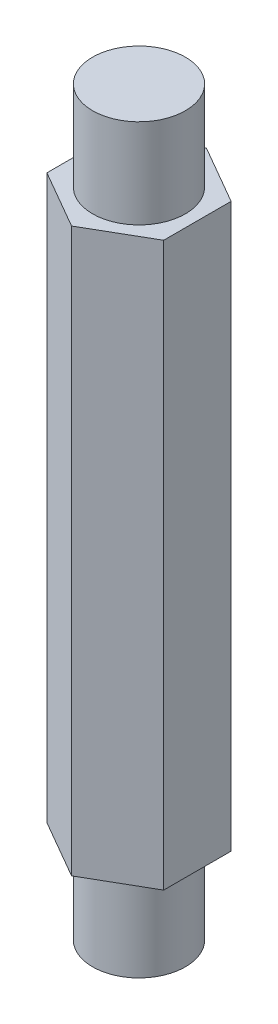
ISO-10303-21;
HEADER;
FILE_DESCRIPTION(('STEP AP214'),'2;1');
FILE_NAME('part.step','',(''),(''),'','','');
FILE_SCHEMA(('AUTOMOTIVE_DESIGN { 1 0 10303 214 1 1 1 1 }'));
ENDSEC;
DATA;
#1=APPLICATION_CONTEXT('core data for automotive mechanical design processes');
#2=APPLICATION_PROTOCOL_DEFINITION('international standard','automotive_design',2000,#1);
#3=PRODUCT_CONTEXT('',#1,'mechanical');
#4=PRODUCT('Part','Part','',(#3));
#5=PRODUCT_RELATED_PRODUCT_CATEGORY('part','',(#4));
#6=PRODUCT_DEFINITION_FORMATION('','',#4);
#7=PRODUCT_DEFINITION_CONTEXT('part definition',#1,'design');
#8=PRODUCT_DEFINITION('design','',#6,#7);
#9=PRODUCT_DEFINITION_SHAPE('','',#8);
#10=(LENGTH_UNIT() NAMED_UNIT(*) SI_UNIT(.MILLI.,.METRE.));
#11=(NAMED_UNIT(*) PLANE_ANGLE_UNIT() SI_UNIT($,.RADIAN.));
#12=(NAMED_UNIT(*) SI_UNIT($,.STERADIAN.) SOLID_ANGLE_UNIT());
#13=UNCERTAINTY_MEASURE_WITH_UNIT(LENGTH_MEASURE(1.E-05),#10,'distance_accuracy_value','');
#14=(GEOMETRIC_REPRESENTATION_CONTEXT(3) GLOBAL_UNCERTAINTY_ASSIGNED_CONTEXT((#13)) GLOBAL_UNIT_ASSIGNED_CONTEXT((#10,
#11,#12)) REPRESENTATION_CONTEXT('',''));
#15=CARTESIAN_POINT('',(0.,0.,0.));
#16=DIRECTION('',(0.,0.,1.));
#17=DIRECTION('',(1.,0.,0.));
#18=AXIS2_PLACEMENT_3D('',#15,#16,#17);
#19=CARTESIAN_POINT('',(0.,23.175,0.));
#20=DIRECTION('',(0.,-1.,0.));
#21=DIRECTION('',(0.,0.,-1.));
#22=AXIS2_PLACEMENT_3D('',#19,#20,#21);
#23=CYLINDRICAL_SURFACE('',#22,1.65);
#24=CARTESIAN_POINT('',(0.,23.175,0.));
#25=DIRECTION('',(0.,1.,0.));
#26=DIRECTION('',(0.,0.,1.));
#27=AXIS2_PLACEMENT_3D('',#24,#25,#26);
#28=CIRCLE('',#27,1.65);
#29=CARTESIAN_POINT('',(0.,23.175,1.65));
#30=VERTEX_POINT('',#29);
#31=EDGE_CURVE('E11',#30,#30,#28,.T.);
#32=ORIENTED_EDGE('',*,*,#31,.F.);
#33=EDGE_LOOP('',(#32));
#34=FACE_BOUND('',#33,.T.);
#35=CARTESIAN_POINT('',(0.,20.,0.));
#36=DIRECTION('',(0.,1.,0.));
#37=DIRECTION('',(0.,0.,1.));
#38=AXIS2_PLACEMENT_3D('',#35,#36,#37);
#39=CIRCLE('',#38,1.65);
#40=CARTESIAN_POINT('',(0.,20.,1.65));
#41=VERTEX_POINT('',#40);
#42=EDGE_CURVE('E45',#41,#41,#39,.T.);
#43=ORIENTED_EDGE('',*,*,#42,.T.);
#44=EDGE_LOOP('',(#43));
#45=FACE_BOUND('',#44,.T.);
#46=ADVANCED_FACE('F42',(#34,#45),#23,.T.);
#47=CARTESIAN_POINT('',(0.,23.175,0.));
#48=DIRECTION('',(0.,1.,0.));
#49=DIRECTION('',(0.,0.,1.));
#50=AXIS2_PLACEMENT_3D('',#47,#48,#49);
#51=PLANE('',#50);
#52=ORIENTED_EDGE('',*,*,#31,.T.);
#53=EDGE_LOOP('',(#52));
#54=FACE_BOUND('',#53,.T.);
#55=ADVANCED_FACE('F57',(#54),#51,.T.);
#56=CARTESIAN_POINT('',(0.,20.,0.));
#57=DIRECTION('',(0.,1.,0.));
#58=DIRECTION('',(0.,0.,1.));
#59=AXIS2_PLACEMENT_3D('',#56,#57,#58);
#60=PLANE('',#59);
#61=ORIENTED_EDGE('',*,*,#42,.F.);
#62=EDGE_LOOP('',(#61));
#63=FACE_BOUND('',#62,.T.);
#64=ADVANCED_FACE('F55',(#63),#60,.F.);
#65=CLOSED_SHELL('',(#46,#55,#64));
#66=MANIFOLD_SOLID_BREP('B2',#65);
#67=CARTESIAN_POINT('',(0.,-3.175,0.));
#68=DIRECTION('',(0.,1.,0.));
#69=DIRECTION('',(0.,0.,1.));
#70=AXIS2_PLACEMENT_3D('',#67,#68,#69);
#71=CYLINDRICAL_SURFACE('',#70,1.65);
#72=CARTESIAN_POINT('',(0.,-3.175,0.));
#73=DIRECTION('',(0.,-1.,0.));
#74=DIRECTION('',(0.,0.,-1.));
#75=AXIS2_PLACEMENT_3D('',#72,#73,#74);
#76=CIRCLE('',#75,1.65);
#77=CARTESIAN_POINT('',(0.,-3.175,-1.65));
#78=VERTEX_POINT('',#77);
#79=EDGE_CURVE('E41',#78,#78,#76,.T.);
#80=ORIENTED_EDGE('',*,*,#79,.F.);
#81=EDGE_LOOP('',(#80));
#82=FACE_BOUND('',#81,.T.);
#83=CARTESIAN_POINT('',(0.,0.,0.));
#84=DIRECTION('',(0.,-1.,0.));
#85=DIRECTION('',(0.,0.,-1.));
#86=AXIS2_PLACEMENT_3D('',#83,#84,#85);
#87=CIRCLE('',#86,1.65);
#88=CARTESIAN_POINT('',(0.,0.,-1.65));
#89=VERTEX_POINT('',#88);
#90=EDGE_CURVE('E94',#89,#89,#87,.T.);
#91=ORIENTED_EDGE('',*,*,#90,.T.);
#92=EDGE_LOOP('',(#91));
#93=FACE_BOUND('',#92,.T.);
#94=ADVANCED_FACE('F91',(#82,#93),#71,.T.);
#95=CARTESIAN_POINT('',(0.,-3.175,0.));
#96=DIRECTION('',(0.,-1.,0.));
#97=DIRECTION('',(0.,0.,-1.));
#98=AXIS2_PLACEMENT_3D('',#95,#96,#97);
#99=PLANE('',#98);
#100=ORIENTED_EDGE('',*,*,#79,.T.);
#101=EDGE_LOOP('',(#100));
#102=FACE_BOUND('',#101,.T.);
#103=ADVANCED_FACE('F106',(#102),#99,.T.);
#104=CARTESIAN_POINT('',(0.,0.,0.));
#105=DIRECTION('',(0.,-1.,0.));
#106=DIRECTION('',(0.,0.,-1.));
#107=AXIS2_PLACEMENT_3D('',#104,#105,#106);
#108=PLANE('',#107);
#109=ORIENTED_EDGE('',*,*,#90,.F.);
#110=EDGE_LOOP('',(#109));
#111=FACE_BOUND('',#110,.T.);
#112=ADVANCED_FACE('F104',(#111),#108,.F.);
#113=CLOSED_SHELL('',(#94,#103,#112));
#114=MANIFOLD_SOLID_BREP('B6',#113);
#115=CARTESIAN_POINT('',(0.,20.,0.));
#116=DIRECTION('',(0.,1.,0.));
#117=DIRECTION('',(0.,0.,1.));
#118=AXIS2_PLACEMENT_3D('',#115,#116,#117);
#119=PLANE('',#118);
#120=DIRECTION('',(0.866025403784439,0.,0.5));
#121=VECTOR('',#120,1.);
#122=CARTESIAN_POINT('',(-2.075,20.,1.19800180856847));
#123=LINE('',#122,#121);
#124=CARTESIAN_POINT('',(-2.075,20.,1.19800180856847));
#125=VERTEX_POINT('',#124);
#126=CARTESIAN_POINT('',(0.,20.,2.39600361713695));
#127=VERTEX_POINT('',#126);
#128=EDGE_CURVE('E228',#125,#127,#123,.T.);
#129=ORIENTED_EDGE('',*,*,#128,.T.);
#130=DIRECTION('',(0.866025403784438,0.,-0.5));
#131=VECTOR('',#130,1.);
#132=CARTESIAN_POINT('',(0.,20.,2.39600361713695));
#133=LINE('',#132,#131);
#134=CARTESIAN_POINT('',(2.075,20.,1.19800180856847));
#135=VERTEX_POINT('',#134);
#136=EDGE_CURVE('E186',#127,#135,#133,.T.);
#137=ORIENTED_EDGE('',*,*,#136,.T.);
#138=DIRECTION('',(0.,0.,-1.));
#139=VECTOR('',#138,1.);
#140=CARTESIAN_POINT('',(2.075,20.,1.19800180856847));
#141=LINE('',#140,#139);
#142=CARTESIAN_POINT('',(2.075,20.,-1.19800180856847));
#143=VERTEX_POINT('',#142);
#144=EDGE_CURVE('E199',#135,#143,#141,.T.);
#145=ORIENTED_EDGE('',*,*,#144,.T.);
#146=DIRECTION('',(-0.866025403784439,0.,-0.5));
#147=VECTOR('',#146,1.);
#148=CARTESIAN_POINT('',(2.075,20.,-1.19800180856847));
#149=LINE('',#148,#147);
#150=CARTESIAN_POINT('',(0.,20.,-2.39600361713695));
#151=VERTEX_POINT('',#150);
#152=EDGE_CURVE('E193',#143,#151,#149,.T.);
#153=ORIENTED_EDGE('',*,*,#152,.T.);
#154=DIRECTION('',(-0.866025403784439,0.,0.5));
#155=VECTOR('',#154,1.);
#156=CARTESIAN_POINT('',(0.,20.,-2.39600361713695));
#157=LINE('',#156,#155);
#158=CARTESIAN_POINT('',(-2.075,20.,-1.19800180856847));
#159=VERTEX_POINT('',#158);
#160=EDGE_CURVE('E197',#151,#159,#157,.T.);
#161=ORIENTED_EDGE('',*,*,#160,.T.);
#162=DIRECTION('',(0.,0.,1.));
#163=VECTOR('',#162,1.);
#164=CARTESIAN_POINT('',(-2.075,20.,-1.19800180856847));
#165=LINE('',#164,#163);
#166=EDGE_CURVE('E149',#159,#125,#165,.T.);
#167=ORIENTED_EDGE('',*,*,#166,.T.);
#168=EDGE_LOOP('',(#129,#137,#145,#153,#161,#167));
#169=FACE_BOUND('',#168,.T.);
#170=CARTESIAN_POINT('',(0.,20.,0.));
#171=DIRECTION('',(0.,1.,0.));
#172=DIRECTION('',(0.,0.,1.));
#173=AXIS2_PLACEMENT_3D('',#170,#171,#172);
#174=CIRCLE('',#173,1.65);
#175=CARTESIAN_POINT('',(0.,20.,1.65));
#176=VERTEX_POINT('',#175);
#177=EDGE_CURVE('E221',#176,#176,#174,.T.);
#178=ORIENTED_EDGE('',*,*,#177,.F.);
#179=EDGE_LOOP('',(#178));
#180=FACE_BOUND('',#179,.T.);
#181=ADVANCED_FACE('F132',(#169,#180),#119,.T.);
#182=CARTESIAN_POINT('',(0.,0.,0.));
#183=DIRECTION('',(0.,1.,0.));
#184=DIRECTION('',(0.,0.,1.));
#185=AXIS2_PLACEMENT_3D('',#182,#183,#184);
#186=PLANE('',#185);
#187=DIRECTION('',(0.866025403784439,0.,0.5));
#188=VECTOR('',#187,1.);
#189=CARTESIAN_POINT('',(-2.075,0.,1.19800180856847));
#190=LINE('',#189,#188);
#191=CARTESIAN_POINT('',(-2.075,0.,1.19800180856847));
#192=VERTEX_POINT('',#191);
#193=CARTESIAN_POINT('',(0.,0.,2.39600361713695));
#194=VERTEX_POINT('',#193);
#195=EDGE_CURVE('E217',#192,#194,#190,.T.);
#196=ORIENTED_EDGE('',*,*,#195,.F.);
#197=DIRECTION('',(0.,0.,1.));
#198=VECTOR('',#197,1.);
#199=CARTESIAN_POINT('',(-2.075,0.,-1.19800180856847));
#200=LINE('',#199,#198);
#201=CARTESIAN_POINT('',(-2.075,0.,-1.19800180856847));
#202=VERTEX_POINT('',#201);
#203=EDGE_CURVE('E178',#202,#192,#200,.T.);
#204=ORIENTED_EDGE('',*,*,#203,.F.);
#205=DIRECTION('',(-0.866025403784439,0.,0.5));
#206=VECTOR('',#205,1.);
#207=CARTESIAN_POINT('',(0.,0.,-2.39600361713695));
#208=LINE('',#207,#206);
#209=CARTESIAN_POINT('',(0.,0.,-2.39600361713695));
#210=VERTEX_POINT('',#209);
#211=EDGE_CURVE('E172',#210,#202,#208,.T.);
#212=ORIENTED_EDGE('',*,*,#211,.F.);
#213=DIRECTION('',(-0.866025403784439,0.,-0.5));
#214=VECTOR('',#213,1.);
#215=CARTESIAN_POINT('',(2.075,0.,-1.19800180856847));
#216=LINE('',#215,#214);
#217=CARTESIAN_POINT('',(2.075,0.,-1.19800180856847));
#218=VERTEX_POINT('',#217);
#219=EDGE_CURVE('E207',#218,#210,#216,.T.);
#220=ORIENTED_EDGE('',*,*,#219,.F.);
#221=DIRECTION('',(0.,0.,-1.));
#222=VECTOR('',#221,1.);
#223=CARTESIAN_POINT('',(2.075,0.,1.19800180856847));
#224=LINE('',#223,#222);
#225=CARTESIAN_POINT('',(2.075,0.,1.19800180856847));
#226=VERTEX_POINT('',#225);
#227=EDGE_CURVE('E223',#226,#218,#224,.T.);
#228=ORIENTED_EDGE('',*,*,#227,.F.);
#229=DIRECTION('',(0.866025403784438,0.,-0.5));
#230=VECTOR('',#229,1.);
#231=CARTESIAN_POINT('',(0.,0.,2.39600361713695));
#232=LINE('',#231,#230);
#233=EDGE_CURVE('E220',#194,#226,#232,.T.);
#234=ORIENTED_EDGE('',*,*,#233,.F.);
#235=EDGE_LOOP('',(#196,#204,#212,#220,#228,#234));
#236=FACE_BOUND('',#235,.T.);
#237=CARTESIAN_POINT('',(0.,0.,0.));
#238=DIRECTION('',(0.,1.,0.));
#239=DIRECTION('',(0.,0.,1.));
#240=AXIS2_PLACEMENT_3D('',#237,#238,#239);
#241=CIRCLE('',#240,1.65);
#242=CARTESIAN_POINT('',(0.,0.,1.65));
#243=VERTEX_POINT('',#242);
#244=EDGE_CURVE('E321',#243,#243,#241,.T.);
#245=ORIENTED_EDGE('',*,*,#244,.T.);
#246=EDGE_LOOP('',(#245));
#247=FACE_BOUND('',#246,.T.);
#248=ADVANCED_FACE('F237',(#236,#247),#186,.F.);
#249=CARTESIAN_POINT('',(-2.075,20.,1.19800180856847));
#250=DIRECTION('',(0.5,0.,-0.866025403784439));
#251=DIRECTION('',(-0.866025403784439,0.,-0.5));
#252=AXIS2_PLACEMENT_3D('',#249,#250,#251);
#253=PLANE('',#252);
#254=ORIENTED_EDGE('',*,*,#195,.T.);
#255=DIRECTION('',(0.,-1.,0.));
#256=VECTOR('',#255,1.);
#257=CARTESIAN_POINT('',(0.,20.,2.39600361713695));
#258=LINE('',#257,#256);
#259=EDGE_CURVE('E89',#127,#194,#258,.T.);
#260=ORIENTED_EDGE('',*,*,#259,.F.);
#261=ORIENTED_EDGE('',*,*,#128,.F.);
#262=DIRECTION('',(0.,-1.,0.));
#263=VECTOR('',#262,1.);
#264=CARTESIAN_POINT('',(-2.075,20.,1.19800180856847));
#265=LINE('',#264,#263);
#266=EDGE_CURVE('E213',#125,#192,#265,.T.);
#267=ORIENTED_EDGE('',*,*,#266,.T.);
#268=EDGE_LOOP('',(#254,#260,#261,#267));
#269=FACE_BOUND('',#268,.T.);
#270=ADVANCED_FACE('F134',(#269),#253,.F.);
#271=CARTESIAN_POINT('',(0.,20.,2.39600361713695));
#272=DIRECTION('',(-0.5,0.,-0.866025403784439));
#273=DIRECTION('',(-0.866025403784439,0.,0.5));
#274=AXIS2_PLACEMENT_3D('',#271,#272,#273);
#275=PLANE('',#274);
#276=ORIENTED_EDGE('',*,*,#233,.T.);
#277=DIRECTION('',(0.,-1.,0.));
#278=VECTOR('',#277,1.);
#279=CARTESIAN_POINT('',(2.075,20.,1.19800180856847));
#280=LINE('',#279,#278);
#281=EDGE_CURVE('E141',#135,#226,#280,.T.);
#282=ORIENTED_EDGE('',*,*,#281,.F.);
#283=ORIENTED_EDGE('',*,*,#136,.F.);
#284=ORIENTED_EDGE('',*,*,#259,.T.);
#285=EDGE_LOOP('',(#276,#282,#283,#284));
#286=FACE_BOUND('',#285,.T.);
#287=ADVANCED_FACE('F262',(#286),#275,.F.);
#288=CARTESIAN_POINT('',(2.075,20.,1.19800180856847));
#289=DIRECTION('',(-1.,0.,0.));
#290=DIRECTION('',(0.,0.,1.));
#291=AXIS2_PLACEMENT_3D('',#288,#289,#290);
#292=PLANE('',#291);
#293=ORIENTED_EDGE('',*,*,#227,.T.);
#294=DIRECTION('',(0.,-1.,0.));
#295=VECTOR('',#294,1.);
#296=CARTESIAN_POINT('',(2.075,20.,-1.19800180856847));
#297=LINE('',#296,#295);
#298=EDGE_CURVE('E208',#143,#218,#297,.T.);
#299=ORIENTED_EDGE('',*,*,#298,.F.);
#300=ORIENTED_EDGE('',*,*,#144,.F.);
#301=ORIENTED_EDGE('',*,*,#281,.T.);
#302=EDGE_LOOP('',(#293,#299,#300,#301));
#303=FACE_BOUND('',#302,.T.);
#304=ADVANCED_FACE('F234',(#303),#292,.F.);
#305=CARTESIAN_POINT('',(2.075,20.,-1.19800180856847));
#306=DIRECTION('',(-0.5,0.,0.866025403784439));
#307=DIRECTION('',(0.866025403784439,0.,0.5));
#308=AXIS2_PLACEMENT_3D('',#305,#306,#307);
#309=PLANE('',#308);
#310=ORIENTED_EDGE('',*,*,#219,.T.);
#311=DIRECTION('',(0.,-1.,0.));
#312=VECTOR('',#311,1.);
#313=CARTESIAN_POINT('',(0.,20.,-2.39600361713695));
#314=LINE('',#313,#312);
#315=EDGE_CURVE('E204',#151,#210,#314,.T.);
#316=ORIENTED_EDGE('',*,*,#315,.F.);
#317=ORIENTED_EDGE('',*,*,#152,.F.);
#318=ORIENTED_EDGE('',*,*,#298,.T.);
#319=EDGE_LOOP('',(#310,#316,#317,#318));
#320=FACE_BOUND('',#319,.T.);
#321=ADVANCED_FACE('F205',(#320),#309,.F.);
#322=CARTESIAN_POINT('',(0.,20.,-2.39600361713695));
#323=DIRECTION('',(0.5,0.,0.866025403784439));
#324=DIRECTION('',(0.866025403784439,0.,-0.5));
#325=AXIS2_PLACEMENT_3D('',#322,#323,#324);
#326=PLANE('',#325);
#327=ORIENTED_EDGE('',*,*,#211,.T.);
#328=DIRECTION('',(0.,-1.,0.));
#329=VECTOR('',#328,1.);
#330=CARTESIAN_POINT('',(-2.075,20.,-1.19800180856847));
#331=LINE('',#330,#329);
#332=EDGE_CURVE('E209',#159,#202,#331,.T.);
#333=ORIENTED_EDGE('',*,*,#332,.F.);
#334=ORIENTED_EDGE('',*,*,#160,.F.);
#335=ORIENTED_EDGE('',*,*,#315,.T.);
#336=EDGE_LOOP('',(#327,#333,#334,#335));
#337=FACE_BOUND('',#336,.T.);
#338=ADVANCED_FACE('F211',(#337),#326,.F.);
#339=CARTESIAN_POINT('',(-2.075,20.,-1.19800180856847));
#340=DIRECTION('',(1.,0.,0.));
#341=DIRECTION('',(0.,0.,-1.));
#342=AXIS2_PLACEMENT_3D('',#339,#340,#341);
#343=PLANE('',#342);
#344=ORIENTED_EDGE('',*,*,#203,.T.);
#345=ORIENTED_EDGE('',*,*,#266,.F.);
#346=ORIENTED_EDGE('',*,*,#166,.F.);
#347=ORIENTED_EDGE('',*,*,#332,.T.);
#348=EDGE_LOOP('',(#344,#345,#346,#347));
#349=FACE_BOUND('',#348,.T.);
#350=ADVANCED_FACE('F242',(#349),#343,.F.);
#351=CARTESIAN_POINT('',(0.,20.,0.));
#352=DIRECTION('',(0.,-1.,0.));
#353=DIRECTION('',(0.,0.,-1.));
#354=AXIS2_PLACEMENT_3D('',#351,#352,#353);
#355=CYLINDRICAL_SURFACE('',#354,1.65);
#356=ORIENTED_EDGE('',*,*,#177,.T.);
#357=EDGE_LOOP('',(#356));
#358=FACE_BOUND('',#357,.T.);
#359=ORIENTED_EDGE('',*,*,#244,.F.);
#360=EDGE_LOOP('',(#359));
#361=FACE_BOUND('',#360,.T.);
#362=ADVANCED_FACE('F244',(#358,#361),#355,.F.);
#363=CLOSED_SHELL('',(#181,#248,#270,#287,#304,#321,#338,#350,#362));
#364=MANIFOLD_SOLID_BREP('B36',#363);
#365=ADVANCED_BREP_SHAPE_REPRESENTATION('',(#18,#66,#114,#364),#14);
#366=SHAPE_DEFINITION_REPRESENTATION(#9,#365);
ENDSEC;
END-ISO-10303-21;
